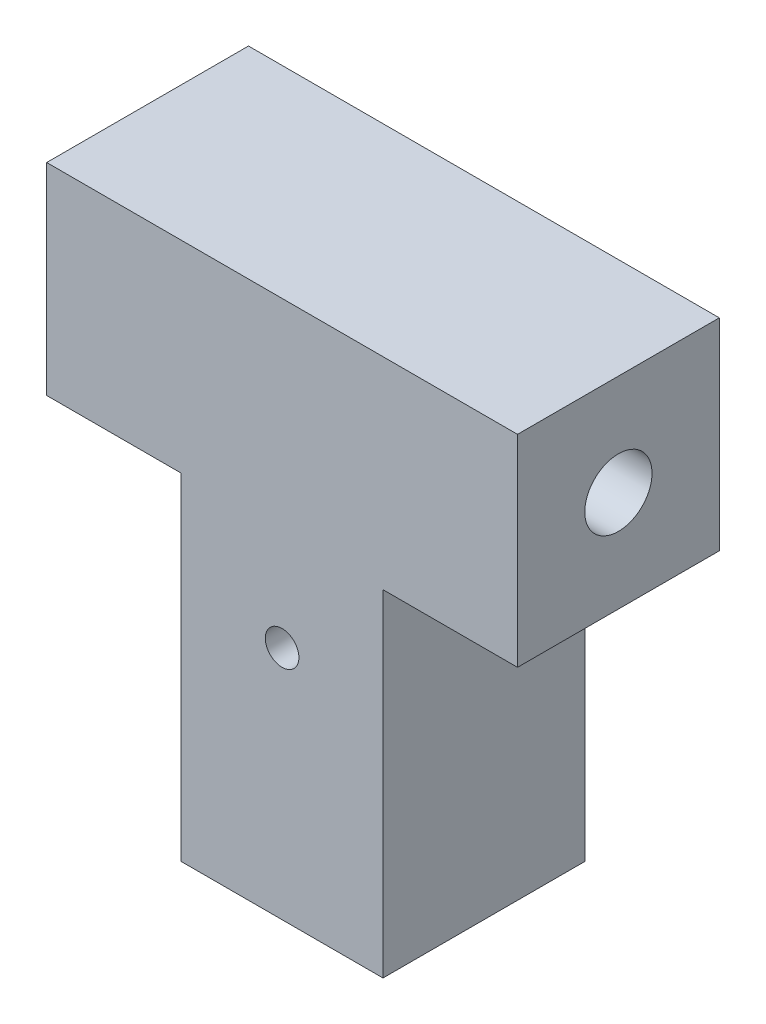
ISO-10303-21;
HEADER;
FILE_DESCRIPTION(('STEP AP214'),'2;1');
FILE_NAME('part.step','',(''),(''),'','','');
FILE_SCHEMA(('AUTOMOTIVE_DESIGN { 1 0 10303 214 1 1 1 1 }'));
ENDSEC;
DATA;
#1=APPLICATION_CONTEXT('core data for automotive mechanical design processes');
#2=APPLICATION_PROTOCOL_DEFINITION('international standard','automotive_design',2000,#1);
#3=PRODUCT_CONTEXT('',#1,'mechanical');
#4=PRODUCT('Part','Part','',(#3));
#5=PRODUCT_RELATED_PRODUCT_CATEGORY('part','',(#4));
#6=PRODUCT_DEFINITION_FORMATION('','',#4);
#7=PRODUCT_DEFINITION_CONTEXT('part definition',#1,'design');
#8=PRODUCT_DEFINITION('design','',#6,#7);
#9=PRODUCT_DEFINITION_SHAPE('','',#8);
#10=(LENGTH_UNIT() NAMED_UNIT(*) SI_UNIT(.MILLI.,.METRE.));
#11=(NAMED_UNIT(*) PLANE_ANGLE_UNIT() SI_UNIT($,.RADIAN.));
#12=(NAMED_UNIT(*) SI_UNIT($,.STERADIAN.) SOLID_ANGLE_UNIT());
#13=UNCERTAINTY_MEASURE_WITH_UNIT(LENGTH_MEASURE(1.E-05),#10,'distance_accuracy_value','');
#14=(GEOMETRIC_REPRESENTATION_CONTEXT(3) GLOBAL_UNCERTAINTY_ASSIGNED_CONTEXT((#13)) GLOBAL_UNIT_ASSIGNED_CONTEXT((#10,
#11,#12)) REPRESENTATION_CONTEXT('',''));
#15=CARTESIAN_POINT('',(0.,0.,0.));
#16=DIRECTION('',(0.,0.,1.));
#17=DIRECTION('',(1.,0.,0.));
#18=AXIS2_PLACEMENT_3D('',#15,#16,#17);
#19=CARTESIAN_POINT('',(-6.,20.,6.));
#20=DIRECTION('',(1.,0.,0.));
#21=DIRECTION('',(0.,0.,-1.));
#22=AXIS2_PLACEMENT_3D('',#19,#20,#21);
#23=PLANE('',#22);
#24=DIRECTION('',(0.,0.,1.));
#25=VECTOR('',#24,1.);
#26=CARTESIAN_POINT('',(-6.,0.,6.));
#27=LINE('',#26,#25);
#28=CARTESIAN_POINT('',(-6.,0.,-6.));
#29=VERTEX_POINT('',#28);
#30=CARTESIAN_POINT('',(-6.,0.,6.));
#31=VERTEX_POINT('',#30);
#32=EDGE_CURVE('E137',#29,#31,#27,.T.);
#33=ORIENTED_EDGE('',*,*,#32,.T.);
#34=DIRECTION('',(0.,-1.,0.));
#35=VECTOR('',#34,1.);
#36=CARTESIAN_POINT('',(-6.,20.,6.));
#37=LINE('',#36,#35);
#38=CARTESIAN_POINT('',(-6.,20.,6.));
#39=VERTEX_POINT('',#38);
#40=EDGE_CURVE('E11',#39,#31,#37,.T.);
#41=ORIENTED_EDGE('',*,*,#40,.F.);
#42=DIRECTION('',(0.,0.,1.));
#43=VECTOR('',#42,1.);
#44=CARTESIAN_POINT('',(-6.,20.,6.));
#45=LINE('',#44,#43);
#46=CARTESIAN_POINT('',(-6.,20.,-6.));
#47=VERTEX_POINT('',#46);
#48=EDGE_CURVE('E145',#47,#39,#45,.T.);
#49=ORIENTED_EDGE('',*,*,#48,.F.);
#50=DIRECTION('',(0.,-1.,0.));
#51=VECTOR('',#50,1.);
#52=CARTESIAN_POINT('',(-6.,20.,-6.));
#53=LINE('',#52,#51);
#54=EDGE_CURVE('E57',#47,#29,#53,.T.);
#55=ORIENTED_EDGE('',*,*,#54,.T.);
#56=EDGE_LOOP('',(#33,#41,#49,#55));
#57=FACE_BOUND('',#56,.T.);
#58=ADVANCED_FACE('F35',(#57),#23,.F.);
#59=CARTESIAN_POINT('',(6.,20.,6.));
#60=DIRECTION('',(0.,0.,-1.));
#61=DIRECTION('',(-1.,0.,0.));
#62=AXIS2_PLACEMENT_3D('',#59,#60,#61);
#63=PLANE('',#62);
#64=CARTESIAN_POINT('',(0.,14.,6.));
#65=DIRECTION('',(0.,0.,1.));
#66=DIRECTION('',(1.,0.,0.));
#67=AXIS2_PLACEMENT_3D('',#64,#65,#66);
#68=CIRCLE('',#67,1.);
#69=CARTESIAN_POINT('',(1.,14.,6.));
#70=VERTEX_POINT('',#69);
#71=EDGE_CURVE('E223',#70,#70,#68,.T.);
#72=ORIENTED_EDGE('',*,*,#71,.F.);
#73=EDGE_LOOP('',(#72));
#74=FACE_BOUND('',#73,.T.);
#75=DIRECTION('',(1.,0.,0.));
#76=VECTOR('',#75,1.);
#77=CARTESIAN_POINT('',(6.,0.,6.));
#78=LINE('',#77,#76);
#79=CARTESIAN_POINT('',(6.,0.,6.));
#80=VERTEX_POINT('',#79);
#81=EDGE_CURVE('E139',#31,#80,#78,.T.);
#82=ORIENTED_EDGE('',*,*,#81,.T.);
#83=DIRECTION('',(0.,-1.,0.));
#84=VECTOR('',#83,1.);
#85=CARTESIAN_POINT('',(6.,20.,6.));
#86=LINE('',#85,#84);
#87=CARTESIAN_POINT('',(6.,20.,6.));
#88=VERTEX_POINT('',#87);
#89=EDGE_CURVE('E48',#88,#80,#86,.T.);
#90=ORIENTED_EDGE('',*,*,#89,.F.);
#91=DIRECTION('',(1.,0.,0.));
#92=VECTOR('',#91,1.);
#93=CARTESIAN_POINT('',(14.,20.,6.));
#94=LINE('',#93,#92);
#95=CARTESIAN_POINT('',(14.,20.,6.));
#96=VERTEX_POINT('',#95);
#97=EDGE_CURVE('E195',#88,#96,#94,.T.);
#98=ORIENTED_EDGE('',*,*,#97,.T.);
#99=DIRECTION('',(0.,-1.,0.));
#100=VECTOR('',#99,1.);
#101=CARTESIAN_POINT('',(14.,32.,6.));
#102=LINE('',#101,#100);
#103=CARTESIAN_POINT('',(14.,32.,6.));
#104=VERTEX_POINT('',#103);
#105=EDGE_CURVE('E119',#104,#96,#102,.T.);
#106=ORIENTED_EDGE('',*,*,#105,.F.);
#107=DIRECTION('',(1.,0.,0.));
#108=VECTOR('',#107,1.);
#109=CARTESIAN_POINT('',(14.,32.,6.));
#110=LINE('',#109,#108);
#111=CARTESIAN_POINT('',(-14.,32.,6.));
#112=VERTEX_POINT('',#111);
#113=EDGE_CURVE('E111',#112,#104,#110,.T.);
#114=ORIENTED_EDGE('',*,*,#113,.F.);
#115=DIRECTION('',(0.,-1.,0.));
#116=VECTOR('',#115,1.);
#117=CARTESIAN_POINT('',(-14.,32.,6.));
#118=LINE('',#117,#116);
#119=CARTESIAN_POINT('',(-14.,20.,6.));
#120=VERTEX_POINT('',#119);
#121=EDGE_CURVE('E116',#112,#120,#118,.T.);
#122=ORIENTED_EDGE('',*,*,#121,.T.);
#123=EDGE_CURVE('E192',#120,#39,#94,.T.);
#124=ORIENTED_EDGE('',*,*,#123,.T.);
#125=ORIENTED_EDGE('',*,*,#40,.T.);
#126=EDGE_LOOP('',(#82,#90,#98,#106,#114,#122,#124,#125));
#127=FACE_BOUND('',#126,.T.);
#128=ADVANCED_FACE('F113',(#74,#127),#63,.F.);
#129=CARTESIAN_POINT('',(6.,20.,6.));
#130=DIRECTION('',(-1.,0.,0.));
#131=DIRECTION('',(0.,0.,1.));
#132=AXIS2_PLACEMENT_3D('',#129,#130,#131);
#133=PLANE('',#132);
#134=DIRECTION('',(0.,0.,-1.));
#135=VECTOR('',#134,1.);
#136=CARTESIAN_POINT('',(6.,0.,6.));
#137=LINE('',#136,#135);
#138=CARTESIAN_POINT('',(6.,0.,-6.));
#139=VERTEX_POINT('',#138);
#140=EDGE_CURVE('E76',#80,#139,#137,.T.);
#141=ORIENTED_EDGE('',*,*,#140,.T.);
#142=DIRECTION('',(0.,-1.,0.));
#143=VECTOR('',#142,1.);
#144=CARTESIAN_POINT('',(6.,20.,-6.));
#145=LINE('',#144,#143);
#146=CARTESIAN_POINT('',(6.,20.,-6.));
#147=VERTEX_POINT('',#146);
#148=EDGE_CURVE('E154',#147,#139,#145,.T.);
#149=ORIENTED_EDGE('',*,*,#148,.F.);
#150=DIRECTION('',(0.,0.,-1.));
#151=VECTOR('',#150,1.);
#152=CARTESIAN_POINT('',(6.,20.,6.));
#153=LINE('',#152,#151);
#154=EDGE_CURVE('E147',#88,#147,#153,.T.);
#155=ORIENTED_EDGE('',*,*,#154,.F.);
#156=ORIENTED_EDGE('',*,*,#89,.T.);
#157=EDGE_LOOP('',(#141,#149,#155,#156));
#158=FACE_BOUND('',#157,.T.);
#159=ADVANCED_FACE('F187',(#158),#133,.F.);
#160=CARTESIAN_POINT('',(6.,20.,-6.));
#161=DIRECTION('',(0.,0.,1.));
#162=DIRECTION('',(1.,0.,0.));
#163=AXIS2_PLACEMENT_3D('',#160,#161,#162);
#164=PLANE('',#163);
#165=CARTESIAN_POINT('',(0.,14.,-6.));
#166=DIRECTION('',(0.,0.,1.));
#167=DIRECTION('',(1.,0.,0.));
#168=AXIS2_PLACEMENT_3D('',#165,#166,#167);
#169=CIRCLE('',#168,1.);
#170=CARTESIAN_POINT('',(1.,14.,-6.));
#171=VERTEX_POINT('',#170);
#172=EDGE_CURVE('E160',#171,#171,#169,.T.);
#173=ORIENTED_EDGE('',*,*,#172,.T.);
#174=EDGE_LOOP('',(#173));
#175=FACE_BOUND('',#174,.T.);
#176=DIRECTION('',(-1.,0.,0.));
#177=VECTOR('',#176,1.);
#178=CARTESIAN_POINT('',(6.,0.,-6.));
#179=LINE('',#178,#177);
#180=EDGE_CURVE('E79',#139,#29,#179,.T.);
#181=ORIENTED_EDGE('',*,*,#180,.T.);
#182=ORIENTED_EDGE('',*,*,#54,.F.);
#183=DIRECTION('',(-1.,0.,0.));
#184=VECTOR('',#183,1.);
#185=CARTESIAN_POINT('',(14.,20.,-6.));
#186=LINE('',#185,#184);
#187=CARTESIAN_POINT('',(-14.,20.,-6.));
#188=VERTEX_POINT('',#187);
#189=EDGE_CURVE('E197',#47,#188,#186,.T.);
#190=ORIENTED_EDGE('',*,*,#189,.T.);
#191=DIRECTION('',(0.,-1.,0.));
#192=VECTOR('',#191,1.);
#193=CARTESIAN_POINT('',(-14.,32.,-6.));
#194=LINE('',#193,#192);
#195=CARTESIAN_POINT('',(-14.,32.,-6.));
#196=VERTEX_POINT('',#195);
#197=EDGE_CURVE('E204',#196,#188,#194,.T.);
#198=ORIENTED_EDGE('',*,*,#197,.F.);
#199=DIRECTION('',(-1.,0.,0.));
#200=VECTOR('',#199,1.);
#201=CARTESIAN_POINT('',(14.,32.,-6.));
#202=LINE('',#201,#200);
#203=CARTESIAN_POINT('',(14.,32.,-6.));
#204=VERTEX_POINT('',#203);
#205=EDGE_CURVE('E128',#204,#196,#202,.T.);
#206=ORIENTED_EDGE('',*,*,#205,.F.);
#207=DIRECTION('',(0.,-1.,0.));
#208=VECTOR('',#207,1.);
#209=CARTESIAN_POINT('',(14.,32.,-6.));
#210=LINE('',#209,#208);
#211=CARTESIAN_POINT('',(14.,20.,-6.));
#212=VERTEX_POINT('',#211);
#213=EDGE_CURVE('E141',#204,#212,#210,.T.);
#214=ORIENTED_EDGE('',*,*,#213,.T.);
#215=EDGE_CURVE('E132',#212,#147,#186,.T.);
#216=ORIENTED_EDGE('',*,*,#215,.T.);
#217=ORIENTED_EDGE('',*,*,#148,.T.);
#218=EDGE_LOOP('',(#181,#182,#190,#198,#206,#214,#216,#217));
#219=FACE_BOUND('',#218,.T.);
#220=ADVANCED_FACE('F208',(#175,#219),#164,.F.);
#221=CARTESIAN_POINT('',(0.,0.,0.));
#222=DIRECTION('',(0.,1.,0.));
#223=DIRECTION('',(0.,0.,1.));
#224=AXIS2_PLACEMENT_3D('',#221,#222,#223);
#225=PLANE('',#224);
#226=CARTESIAN_POINT('',(0.,0.,0.));
#227=DIRECTION('',(0.,-1.,0.));
#228=DIRECTION('',(0.,0.,-1.));
#229=AXIS2_PLACEMENT_3D('',#226,#227,#228);
#230=CIRCLE('',#229,2.5);
#231=CARTESIAN_POINT('',(0.,0.,-2.5));
#232=VERTEX_POINT('',#231);
#233=EDGE_CURVE('E218',#232,#232,#230,.T.);
#234=ORIENTED_EDGE('',*,*,#233,.F.);
#235=EDGE_LOOP('',(#234));
#236=FACE_BOUND('',#235,.T.);
#237=ORIENTED_EDGE('',*,*,#32,.F.);
#238=ORIENTED_EDGE('',*,*,#180,.F.);
#239=ORIENTED_EDGE('',*,*,#140,.F.);
#240=ORIENTED_EDGE('',*,*,#81,.F.);
#241=EDGE_LOOP('',(#237,#238,#239,#240));
#242=FACE_BOUND('',#241,.T.);
#243=ADVANCED_FACE('F191',(#236,#242),#225,.F.);
#244=CARTESIAN_POINT('',(0.,20.,0.));
#245=DIRECTION('',(0.,1.,0.));
#246=DIRECTION('',(0.,0.,1.));
#247=AXIS2_PLACEMENT_3D('',#244,#245,#246);
#248=PLANE('',#247);
#249=ORIENTED_EDGE('',*,*,#189,.F.);
#250=ORIENTED_EDGE('',*,*,#48,.T.);
#251=ORIENTED_EDGE('',*,*,#123,.F.);
#252=DIRECTION('',(0.,0.,1.));
#253=VECTOR('',#252,1.);
#254=CARTESIAN_POINT('',(-14.,20.,6.));
#255=LINE('',#254,#253);
#256=EDGE_CURVE('E136',#188,#120,#255,.T.);
#257=ORIENTED_EDGE('',*,*,#256,.F.);
#258=EDGE_LOOP('',(#249,#250,#251,#257));
#259=FACE_BOUND('',#258,.T.);
#260=ADVANCED_FACE('F247',(#259),#248,.F.);
#261=ORIENTED_EDGE('',*,*,#97,.F.);
#262=ORIENTED_EDGE('',*,*,#154,.T.);
#263=ORIENTED_EDGE('',*,*,#215,.F.);
#264=DIRECTION('',(0.,0.,-1.));
#265=VECTOR('',#264,1.);
#266=CARTESIAN_POINT('',(14.,20.,6.));
#267=LINE('',#266,#265);
#268=EDGE_CURVE('E194',#96,#212,#267,.T.);
#269=ORIENTED_EDGE('',*,*,#268,.F.);
#270=EDGE_LOOP('',(#261,#262,#263,#269));
#271=FACE_BOUND('',#270,.T.);
#272=ADVANCED_FACE('F213',(#271),#248,.F.);
#273=CARTESIAN_POINT('',(-14.,32.,6.));
#274=DIRECTION('',(1.,0.,0.));
#275=DIRECTION('',(0.,0.,-1.));
#276=AXIS2_PLACEMENT_3D('',#273,#274,#275);
#277=PLANE('',#276);
#278=CARTESIAN_POINT('',(-14.,26.,0.));
#279=DIRECTION('',(-1.,0.,0.));
#280=DIRECTION('',(0.,0.,1.));
#281=AXIS2_PLACEMENT_3D('',#278,#279,#280);
#282=CIRCLE('',#281,2.);
#283=CARTESIAN_POINT('',(-14.,26.,2.));
#284=VERTEX_POINT('',#283);
#285=EDGE_CURVE('E229',#284,#284,#282,.T.);
#286=ORIENTED_EDGE('',*,*,#285,.F.);
#287=EDGE_LOOP('',(#286));
#288=FACE_BOUND('',#287,.T.);
#289=ORIENTED_EDGE('',*,*,#256,.T.);
#290=ORIENTED_EDGE('',*,*,#121,.F.);
#291=DIRECTION('',(0.,0.,1.));
#292=VECTOR('',#291,1.);
#293=CARTESIAN_POINT('',(-14.,32.,6.));
#294=LINE('',#293,#292);
#295=EDGE_CURVE('E123',#196,#112,#294,.T.);
#296=ORIENTED_EDGE('',*,*,#295,.F.);
#297=ORIENTED_EDGE('',*,*,#197,.T.);
#298=EDGE_LOOP('',(#289,#290,#296,#297));
#299=FACE_BOUND('',#298,.T.);
#300=ADVANCED_FACE('F134',(#288,#299),#277,.F.);
#301=CARTESIAN_POINT('',(14.,32.,6.));
#302=DIRECTION('',(-1.,0.,0.));
#303=DIRECTION('',(0.,0.,1.));
#304=AXIS2_PLACEMENT_3D('',#301,#302,#303);
#305=PLANE('',#304);
#306=CARTESIAN_POINT('',(14.,26.,0.));
#307=DIRECTION('',(-1.,0.,0.));
#308=DIRECTION('',(0.,0.,1.));
#309=AXIS2_PLACEMENT_3D('',#306,#307,#308);
#310=CIRCLE('',#309,2.);
#311=CARTESIAN_POINT('',(14.,26.,2.));
#312=VERTEX_POINT('',#311);
#313=EDGE_CURVE('E226',#312,#312,#310,.T.);
#314=ORIENTED_EDGE('',*,*,#313,.T.);
#315=EDGE_LOOP('',(#314));
#316=FACE_BOUND('',#315,.T.);
#317=ORIENTED_EDGE('',*,*,#268,.T.);
#318=ORIENTED_EDGE('',*,*,#213,.F.);
#319=DIRECTION('',(0.,0.,-1.));
#320=VECTOR('',#319,1.);
#321=CARTESIAN_POINT('',(14.,32.,6.));
#322=LINE('',#321,#320);
#323=EDGE_CURVE('E122',#104,#204,#322,.T.);
#324=ORIENTED_EDGE('',*,*,#323,.F.);
#325=ORIENTED_EDGE('',*,*,#105,.T.);
#326=EDGE_LOOP('',(#317,#318,#324,#325));
#327=FACE_BOUND('',#326,.T.);
#328=ADVANCED_FACE('F215',(#316,#327),#305,.F.);
#329=CARTESIAN_POINT('',(0.,32.,0.));
#330=DIRECTION('',(0.,1.,0.));
#331=DIRECTION('',(0.,0.,1.));
#332=AXIS2_PLACEMENT_3D('',#329,#330,#331);
#333=PLANE('',#332);
#334=ORIENTED_EDGE('',*,*,#295,.T.);
#335=ORIENTED_EDGE('',*,*,#113,.T.);
#336=ORIENTED_EDGE('',*,*,#323,.T.);
#337=ORIENTED_EDGE('',*,*,#205,.T.);
#338=EDGE_LOOP('',(#334,#335,#336,#337));
#339=FACE_BOUND('',#338,.T.);
#340=ADVANCED_FACE('F126',(#339),#333,.T.);
#341=CARTESIAN_POINT('',(0.,20.,0.));
#342=DIRECTION('',(0.,-1.,0.));
#343=DIRECTION('',(0.,0.,-1.));
#344=AXIS2_PLACEMENT_3D('',#341,#342,#343);
#345=CYLINDRICAL_SURFACE('',#344,2.5);
#346=CARTESIAN_POINT('',(0.,15.,-2.5));
#347=CARTESIAN_POINT('',(0.0537465027214458,14.9999950740881,-2.49999635613542));
#348=CARTESIAN_POINT('',(0.107586282045337,14.9956411239558,-2.49824647153466));
#349=CARTESIAN_POINT('',(0.213748240208948,14.9783761482394,-2.49141726550321));
#350=CARTESIAN_POINT('',(0.266065888780624,14.9654418604569,-2.48632889349439));
#351=CARTESIAN_POINT('',(0.367476961363702,14.9315619609706,-2.47337104606559));
#352=CARTESIAN_POINT('',(0.41658033080848,14.9106425768916,-2.46551068182036));
#353=CARTESIAN_POINT('',(0.510535985164184,14.8614904133367,-2.44778305398039));
#354=CARTESIAN_POINT('',(0.555389738375497,14.8332601725405,-2.43791648729028));
#355=CARTESIAN_POINT('',(0.641750503785198,14.7688822507195,-2.41665443085209));
#356=CARTESIAN_POINT('',(0.683031136275107,14.7324466718799,-2.40521148464595));
#357=CARTESIAN_POINT('',(0.759087502392362,14.6532999982616,-2.38230288453097));
#358=CARTESIAN_POINT('',(0.793860053566767,14.6105858513941,-2.37083722226896));
#359=CARTESIAN_POINT('',(0.857437283646441,14.5177859648789,-2.34861395898568));
#360=CARTESIAN_POINT('',(0.885907490597738,14.4674567569884,-2.33791057982476));
#361=CARTESIAN_POINT('',(0.933877359518576,14.36223180079,-2.31916823593396));
#362=CARTESIAN_POINT('',(0.95338128214292,14.3073382360758,-2.31112800622088));
#363=CARTESIAN_POINT('',(0.981949411697937,14.197143833204,-2.29913178830409));
#364=CARTESIAN_POINT('',(0.991446982902827,14.1419743822119,-2.29500710177802));
#365=CARTESIAN_POINT('',(1.00108648082002,14.0306825008464,-2.29082002024572));
#366=CARTESIAN_POINT('',(1.00123300815661,13.9745605526875,-2.29075562761384));
#367=CARTESIAN_POINT('',(0.992494683752276,13.867121664271,-2.29455250139997));
#368=CARTESIAN_POINT('',(0.984237657152572,13.8157421427955,-2.29814087519225));
#369=CARTESIAN_POINT('',(0.959973440148914,13.7151702219966,-2.30838093803918));
#370=CARTESIAN_POINT('',(0.94396489740232,13.6659782059448,-2.31503316160836));
#371=CARTESIAN_POINT('',(0.904347366275541,13.569991081902,-2.33079742544265));
#372=CARTESIAN_POINT('',(0.880589931157664,13.5232653804727,-2.33995689640394));
#373=CARTESIAN_POINT('',(0.826253230366112,13.4342920918192,-2.35969058194945));
#374=CARTESIAN_POINT('',(0.795671402550428,13.3920461952986,-2.37026532728424));
#375=CARTESIAN_POINT('',(0.725775299727223,13.309795135599,-2.39263368371135));
#376=CARTESIAN_POINT('',(0.685968731485323,13.270215635277,-2.40445832488076));
#377=CARTESIAN_POINT('',(0.600157213715101,13.198157760999,-2.42729912479141));
#378=CARTESIAN_POINT('',(0.554151032667222,13.1656808012949,-2.43831512222662));
#379=CARTESIAN_POINT('',(0.456038826302926,13.1081912762921,-2.45857340632274));
#380=CARTESIAN_POINT('',(0.403830245673243,13.0833388594015,-2.46777635047707));
#381=CARTESIAN_POINT('',(0.295511882741446,13.042916069461,-2.48307414164379));
#382=CARTESIAN_POINT('',(0.239404098424842,13.0273409812213,-2.48917056731191));
#383=CARTESIAN_POINT('',(0.128447943803916,13.0067758522901,-2.49728069753455));
#384=CARTESIAN_POINT('',(0.0737216469927732,13.0012137728732,-2.49951472916757));
#385=CARTESIAN_POINT('',(-0.0359226549039027,12.9991434497357,-2.50034239255315));
#386=CARTESIAN_POINT('',(-0.0908406066119561,13.0026328592262,-2.49893696791146));
#387=CARTESIAN_POINT('',(-0.196716369560988,13.018145876276,-2.49278783531877));
#388=CARTESIAN_POINT('',(-0.247741245887732,13.0297789901755,-2.48819695672762));
#389=CARTESIAN_POINT('',(-0.347067714030385,13.0607178541549,-2.4762972070275));
#390=CARTESIAN_POINT('',(-0.395368955112417,13.0800245898343,-2.46898798678265));
#391=CARTESIAN_POINT('',(-0.489539392908346,13.12639246984,-2.45208297385406));
#392=CARTESIAN_POINT('',(-0.535289011377698,13.1536727360216,-2.44242407989902));
#393=CARTESIAN_POINT('',(-0.621721795623273,13.2149701619528,-2.42186682372762));
#394=CARTESIAN_POINT('',(-0.662402920380558,13.2489900214613,-2.41096796555135));
#395=CARTESIAN_POINT('',(-0.740361521514405,13.3254350064748,-2.38822558819056));
#396=CARTESIAN_POINT('',(-0.777236966903028,13.3682667707531,-2.37636720712526));
#397=CARTESIAN_POINT('',(-0.843375598706851,13.4597200415047,-2.35370836458566));
#398=CARTESIAN_POINT('',(-0.87263753066875,13.50834250017,-2.34290807763256));
#399=CARTESIAN_POINT('',(-0.92290375096581,13.6107308472971,-2.32357149953854));
#400=CARTESIAN_POINT('',(-0.943825297267223,13.6645419996062,-2.31505815442394));
#401=CARTESIAN_POINT('',(-0.976148109852649,13.7753668258576,-2.30161836738966));
#402=CARTESIAN_POINT('',(-0.987556402634655,13.8323781029062,-2.29668927847999));
#403=CARTESIAN_POINT('',(-0.999857808639198,13.9435639508873,-2.29135879649963));
#404=CARTESIAN_POINT('',(-1.00144854115143,13.9976474197967,-2.29065710504086));
#405=CARTESIAN_POINT('',(-0.99590157963876,14.1052724288566,-2.29307418016549));
#406=CARTESIAN_POINT('',(-0.988764993956889,14.1588140369513,-2.29619246162397));
#407=CARTESIAN_POINT('',(-0.966535683076822,14.2616660949275,-2.3056332453951));
#408=CARTESIAN_POINT('',(-0.951768746785488,14.3110601372165,-2.31182415913725));
#409=CARTESIAN_POINT('',(-0.915002724245506,14.4066893148067,-2.32662000616348));
#410=CARTESIAN_POINT('',(-0.893001640696906,14.4529235734499,-2.33522560603003));
#411=CARTESIAN_POINT('',(-0.840936381379864,14.5438048096354,-2.35449304802246));
#412=CARTESIAN_POINT('',(-0.810482667579744,14.5882093350652,-2.36524441156621));
#413=CARTESIAN_POINT('',(-0.742946059635747,14.6714966586019,-2.38731902186119));
#414=CARTESIAN_POINT('',(-0.70586116740906,14.7103777860642,-2.39864244024203));
#415=CARTESIAN_POINT('',(-0.623252753136232,14.7841014266318,-2.42146783543697));
#416=CARTESIAN_POINT('',(-0.577338000573069,14.818518653449,-2.43293378981093));
#417=CARTESIAN_POINT('',(-0.479950160142889,14.8791685213108,-2.45400203356858));
#418=CARTESIAN_POINT('',(-0.428474502273618,14.9053973560763,-2.46360345546453));
#419=CARTESIAN_POINT('',(-0.322369031247601,14.9483111075951,-2.47969857407931));
#420=CARTESIAN_POINT('',(-0.267815809109847,14.9651646617802,-2.48624681527514));
#421=CARTESIAN_POINT('',(-0.15643827314061,14.9893195604771,-2.49572153104683));
#422=CARTESIAN_POINT('',(-0.099621762929456,14.996651218372,-2.49865949747819));
#423=CARTESIAN_POINT('',(-0.0284561489454648,14.9996976904891,-2.49987949752068));
#424=CARTESIAN_POINT('',(-0.0142313443703792,15.0000013043146,-2.50000096484588));
#425=CARTESIAN_POINT('',(0.,15.,-2.5));
#426=B_SPLINE_CURVE_WITH_KNOTS('',3,(#346,#347,#348,#349,#350,#351,#352,#353,#354,#355,#356,
#357,#358,#359,#360,#361,#362,#363,#364,#365,#366,#367,#368,#369,#370,#371,#372,#373,#374,#375,
#376,#377,#378,#379,#380,#381,#382,#383,#384,#385,#386,#387,#388,#389,#390,#391,#392,#393,#394,
#395,#396,#397,#398,#399,#400,#401,#402,#403,#404,#405,#406,#407,#408,#409,#410,#411,#412,#413,
#414,#415,#416,#417,#418,#419,#420,#421,#422,#423,#424,#425),.UNSPECIFIED.,.T.,.F.,(4,2,2,2,2,2,
2,2,2,2,2,2,2,2,2,2,2,2,2,2,2,2,2,2,2,2,2,2,2,2,2,2,2,2,2,2,2,2,2,4),(0.,0.161201493946536,
0.322841818003967,0.48395572873579,0.645013767839921,0.812986908501986,0.981041974672057,
1.15657629409608,1.33202711559134,1.49952052654414,1.66693153170244,1.82269164200686,
1.97847893628024,2.13744563149408,2.29647210969092,2.46779174593278,2.63914546419867,
2.81388456581403,2.98853478056895,3.15284592264004,3.31711446785041,3.47400227782183,
3.63091024496899,3.79261756699132,3.95438979749485,4.12684237312207,4.29932334521874,
4.47347522570414,4.64749836322967,4.80899836696374,4.97047786281523,5.12557159274385,
5.28070817902581,5.44472734028347,5.60879600674197,5.78350211766918,5.95828931820267,
6.1298215050666,6.30080626202172,6.34349022948398),.UNSPECIFIED.);
#427=CARTESIAN_POINT('',(0.,15.,-2.5));
#428=VERTEX_POINT('',#427);
#429=EDGE_CURVE('E38',#428,#428,#426,.T.);
#430=ORIENTED_EDGE('',*,*,#429,.T.);
#431=EDGE_LOOP('',(#430));
#432=FACE_BOUND('',#431,.T.);
#433=CARTESIAN_POINT('',(1.,14.,2.29128784747792));
#434=CARTESIAN_POINT('',(0.999994127101898,14.0535697490499,2.29129325828211));
#435=CARTESIAN_POINT('',(0.99566990929718,14.1072152673524,2.29319301242132));
#436=CARTESIAN_POINT('',(0.978534515296369,14.2129674164385,2.30055457093922));
#437=CARTESIAN_POINT('',(0.965701652221069,14.2650697585402,2.30602547693426));
#438=CARTESIAN_POINT('',(0.932117516284356,14.366026470985,2.31980227895648));
#439=CARTESIAN_POINT('',(0.911396076262716,14.4148922736801,2.32809748178557));
#440=CARTESIAN_POINT('',(0.862710134685809,14.5084425254298,2.3465733254764));
#441=CARTESIAN_POINT('',(0.834747214633754,14.5531278845754,2.35675355451961));
#442=CARTESIAN_POINT('',(0.770660987293714,14.6396302011207,2.37850432525516));
#443=CARTESIAN_POINT('',(0.734189678863668,14.6811782114647,2.39011958979373));
#444=CARTESIAN_POINT('',(0.654854552887027,14.7577644986577,2.41306228489405));
#445=CARTESIAN_POINT('',(0.611988510837845,14.7928005006449,2.42438961368186));
#446=CARTESIAN_POINT('',(0.519003155178194,14.8567031984914,2.44601703953427));
#447=CARTESIAN_POINT('',(0.468664482806145,14.8852721507353,2.45625901841784));
#448=CARTESIAN_POINT('',(0.363412661437565,14.9334217841949,2.47401963815773));
#449=CARTESIAN_POINT('',(0.308501384643986,14.953006122891,2.48153938692337));
#450=CARTESIAN_POINT('',(0.198483213419451,14.9816707432187,2.49269162504142));
#451=CARTESIAN_POINT('',(0.143514492402308,14.9912136570445,2.49649468387678));
#452=CARTESIAN_POINT('',(0.0326331643188301,15.0010142428313,2.50040155341351));
#453=CARTESIAN_POINT('',(-0.0232790829126971,15.0012753779674,2.50050674384656));
#454=CARTESIAN_POINT('',(-0.131116247357652,14.9927586151125,2.49710981410893));
#455=CARTESIAN_POINT('',(-0.183088726437013,14.9844876136265,2.49380998385918));
#456=CARTESIAN_POINT('',(-0.284836554609165,14.9600035618446,2.48424645734395));
#457=CARTESIAN_POINT('',(-0.334611742195076,14.9437899287998,2.47798254360556));
#458=CARTESIAN_POINT('',(-0.431448969255825,14.9036817585618,2.4629841222885));
#459=CARTESIAN_POINT('',(-0.478458811689814,14.8796751425922,2.454213802334));
#460=CARTESIAN_POINT('',(-0.567904075370284,14.8247674965405,2.43507292589849));
#461=CARTESIAN_POINT('',(-0.610337921358051,14.7938641034512,2.42470182132537));
#462=CARTESIAN_POINT('',(-0.692384413996073,14.7236754320267,2.40260818589167));
#463=CARTESIAN_POINT('',(-0.731628922636818,14.6839730537081,2.3908416326012));
#464=CARTESIAN_POINT('',(-0.80305370769266,14.5985047140895,2.36780830482389));
#465=CARTESIAN_POINT('',(-0.835231671879826,14.5527367759229,2.35654169488174));
#466=CARTESIAN_POINT('',(-0.892452094371463,14.4547904887955,2.33548448720906));
#467=CARTESIAN_POINT('',(-0.91726732586745,14.4024675847581,2.32574457090691));
#468=CARTESIAN_POINT('',(-0.95758812998313,14.293892254769,2.30943795233662));
#469=CARTESIAN_POINT('',(-0.973099749202197,14.2376424076146,2.3028691896167));
#470=CARTESIAN_POINT('',(-0.993477474415977,14.126482111282,2.29414879836282));
#471=CARTESIAN_POINT('',(-0.998936048404202,14.0716997764399,2.29175183224038));
#472=CARTESIAN_POINT('',(-1.00078066322451,13.961961396116,2.29094748938549));
#473=CARTESIAN_POINT('',(-0.997169455296439,13.9070054083611,2.29253890281232));
#474=CARTESIAN_POINT('',(-0.98151644739426,13.8017705325226,2.29928022178566));
#475=CARTESIAN_POINT('',(-0.969966531011726,13.7514035313002,2.30422228898885));
#476=CARTESIAN_POINT('',(-0.939402093455636,13.653355797607,2.31685025513936));
#477=CARTESIAN_POINT('',(-0.920385917151194,13.6056756634463,2.32453676244372));
#478=CARTESIAN_POINT('',(-0.874567819740725,13.5121988211023,2.34216890929975));
#479=CARTESIAN_POINT('',(-0.847481434132295,13.4665569056528,2.35219352319568));
#480=CARTESIAN_POINT('',(-0.786582612220936,13.3802585062792,2.37325192578919));
#481=CARTESIAN_POINT('',(-0.75276743674099,13.3396040636022,2.38428612448031));
#482=CARTESIAN_POINT('',(-0.67642210584024,13.2613132957004,2.40710457985699));
#483=CARTESIAN_POINT('',(-0.633432714722547,13.2241217173545,2.41888403642601));
#484=CARTESIAN_POINT('',(-0.54154181668442,13.1574114616948,2.44109897283781));
#485=CARTESIAN_POINT('',(-0.49264006923393,13.1278930967014,2.4515343979662));
#486=CARTESIAN_POINT('',(-0.39013996700088,13.0774761867694,2.46991857950143));
#487=CARTESIAN_POINT('',(-0.336542740497032,13.0565755779171,2.47786793120137));
#488=CARTESIAN_POINT('',(-0.226196795459612,13.0242255737962,2.49036356734645));
#489=CARTESIAN_POINT('',(-0.169449805147134,13.01277104928,2.49491169853772));
#490=CARTESIAN_POINT('',(-0.0584082551731503,13.0002476491873,2.49989504105256));
#491=CARTESIAN_POINT('',(-0.00419524629652627,12.9985499357687,2.50057923372437));
#492=CARTESIAN_POINT('',(0.103716917866623,13.0039277396421,2.49843021189296));
#493=CARTESIAN_POINT('',(0.157416149697313,13.0110019288928,2.49559752983456));
#494=CARTESIAN_POINT('',(0.261085450973208,13.0332733941792,2.48685756682127));
#495=CARTESIAN_POINT('',(0.311119402324195,13.0482144730378,2.48104740317165));
#496=CARTESIAN_POINT('',(0.407961177379473,13.0855264022809,2.46697473916019));
#497=CARTESIAN_POINT('',(0.454768404133641,13.1078986230102,2.45871178652006));
#498=CARTESIAN_POINT('',(0.546101520928061,13.1605515992447,2.44009047180029));
#499=CARTESIAN_POINT('',(0.590435193403216,13.1911381474425,2.42965564864115));
#500=CARTESIAN_POINT('',(0.673527014262039,13.2588942595895,2.40794701593224));
#501=CARTESIAN_POINT('',(0.712282842872881,13.2960665482301,2.3966728602525));
#502=CARTESIAN_POINT('',(0.785600632542999,13.3786576122625,2.37368881779711));
#503=CARTESIAN_POINT('',(0.819754443599518,13.4244444367006,2.36199516302692));
#504=CARTESIAN_POINT('',(0.879923725219702,13.5214710687144,2.3402483573759));
#505=CARTESIAN_POINT('',(0.905938238949998,13.5727115164549,2.33019539943728));
#506=CARTESIAN_POINT('',(0.946995543836658,13.674518600924,2.31379432228954));
#507=CARTESIAN_POINT('',(0.962813757082107,13.7247326173756,2.30719459305824));
#508=CARTESIAN_POINT('',(0.986358878909195,13.8272427098152,2.29723001801982));
#509=CARTESIAN_POINT('',(0.994108333944011,13.8795325579835,2.29385616036088));
#510=CARTESIAN_POINT('',(0.99923212915509,13.954688781169,2.29162229378817));
#511=CARTESIAN_POINT('',(1.00000248449744,13.9773376104988,2.29128555846679));
#512=CARTESIAN_POINT('',(1.,14.,2.29128784747792));
#513=B_SPLINE_CURVE_WITH_KNOTS('',3,(#433,#434,#435,#436,#437,#438,#439,#440,#441,#442,#443,
#444,#445,#446,#447,#448,#449,#450,#451,#452,#453,#454,#455,#456,#457,#458,#459,#460,#461,#462,
#463,#464,#465,#466,#467,#468,#469,#470,#471,#472,#473,#474,#475,#476,#477,#478,#479,#480,#481,
#482,#483,#484,#485,#486,#487,#488,#489,#490,#491,#492,#493,#494,#495,#496,#497,#498,#499,#500,
#501,#502,#503,#504,#505,#506,#507,#508,#509,#510,#511,#512),.UNSPECIFIED.,.T.,.F.,(4,2,2,2,2,2,
2,2,2,2,2,2,2,2,2,2,2,2,2,2,2,2,2,2,2,2,2,2,2,2,2,2,2,2,2,2,2,2,2,4),(0.,0.160638824383827,
0.321688667911123,0.482135411646695,0.642547144119308,0.811278091422122,0.980067871741711,
1.15551334545714,1.3308873348474,1.49777091443592,1.66459222652836,1.82204322415151,
1.9795057756453,2.13934150117449,2.29923207470016,2.46962022040678,2.64006403563564,
2.81532229357288,2.99046652397056,3.15491073759215,3.31930507450975,3.47433624039578,
3.62940179322824,3.79075577323356,3.9521755725993,4.12551867120495,4.29886882423379,
4.47217743653411,4.64539187974073,4.80730519874982,4.96919400753306,5.12610997218681,
5.28305488911298,5.44693525566968,5.61088358279108,5.78498126639812,5.959099408766,
6.11758330406544,6.27562315106628,6.34358052760367),.UNSPECIFIED.);
#514=CARTESIAN_POINT('',(1.,14.,2.29128784747792));
#515=VERTEX_POINT('',#514);
#516=EDGE_CURVE('E156',#515,#515,#513,.T.);
#517=ORIENTED_EDGE('',*,*,#516,.T.);
#518=EDGE_LOOP('',(#517));
#519=FACE_BOUND('',#518,.T.);
#520=CARTESIAN_POINT('',(0.,20.,0.));
#521=DIRECTION('',(0.,-1.,0.));
#522=DIRECTION('',(0.,0.,-1.));
#523=AXIS2_PLACEMENT_3D('',#520,#521,#522);
#524=CIRCLE('',#523,2.5);
#525=CARTESIAN_POINT('',(0.,20.,-2.5));
#526=VERTEX_POINT('',#525);
#527=EDGE_CURVE('E221',#526,#526,#524,.T.);
#528=ORIENTED_EDGE('',*,*,#527,.F.);
#529=EDGE_LOOP('',(#528));
#530=FACE_BOUND('',#529,.T.);
#531=ORIENTED_EDGE('',*,*,#233,.T.);
#532=EDGE_LOOP('',(#531));
#533=FACE_BOUND('',#532,.T.);
#534=ADVANCED_FACE('F161',(#432,#519,#530,#533),#345,.F.);
#535=CARTESIAN_POINT('',(0.,20.,0.));
#536=DIRECTION('',(0.,-1.,0.));
#537=DIRECTION('',(0.,0.,-1.));
#538=AXIS2_PLACEMENT_3D('',#535,#536,#537);
#539=PLANE('',#538);
#540=ORIENTED_EDGE('',*,*,#527,.T.);
#541=EDGE_LOOP('',(#540));
#542=FACE_BOUND('',#541,.T.);
#543=ADVANCED_FACE('F172',(#542),#539,.T.);
#544=CARTESIAN_POINT('',(0.,14.,-6.));
#545=DIRECTION('',(0.,0.,1.));
#546=DIRECTION('',(1.,0.,0.));
#547=AXIS2_PLACEMENT_3D('',#544,#545,#546);
#548=CYLINDRICAL_SURFACE('',#547,1.);
#549=ORIENTED_EDGE('',*,*,#71,.T.);
#550=EDGE_LOOP('',(#549));
#551=FACE_BOUND('',#550,.T.);
#552=ORIENTED_EDGE('',*,*,#516,.F.);
#553=EDGE_LOOP('',(#552));
#554=FACE_BOUND('',#553,.T.);
#555=ADVANCED_FACE('F170',(#551,#554),#548,.F.);
#556=ORIENTED_EDGE('',*,*,#172,.F.);
#557=EDGE_LOOP('',(#556));
#558=FACE_BOUND('',#557,.T.);
#559=ORIENTED_EDGE('',*,*,#429,.F.);
#560=EDGE_LOOP('',(#559));
#561=FACE_BOUND('',#560,.T.);
#562=ADVANCED_FACE('F165',(#558,#561),#548,.F.);
#563=CARTESIAN_POINT('',(14.,26.,0.));
#564=DIRECTION('',(-1.,0.,0.));
#565=DIRECTION('',(0.,0.,1.));
#566=AXIS2_PLACEMENT_3D('',#563,#564,#565);
#567=CYLINDRICAL_SURFACE('',#566,2.);
#568=ORIENTED_EDGE('',*,*,#313,.F.);
#569=EDGE_LOOP('',(#568));
#570=FACE_BOUND('',#569,.T.);
#571=ORIENTED_EDGE('',*,*,#285,.T.);
#572=EDGE_LOOP('',(#571));
#573=FACE_BOUND('',#572,.T.);
#574=ADVANCED_FACE('F169',(#570,#573),#567,.F.);
#575=CLOSED_SHELL('',(#58,#128,#159,#220,#243,#260,#272,#300,#328,#340,#534,#543,#555,#562,#574));
#576=MANIFOLD_SOLID_BREP('B2',#575);
#577=ADVANCED_BREP_SHAPE_REPRESENTATION('',(#18,#576),#14);
#578=SHAPE_DEFINITION_REPRESENTATION(#9,#577);
ENDSEC;
END-ISO-10303-21;
